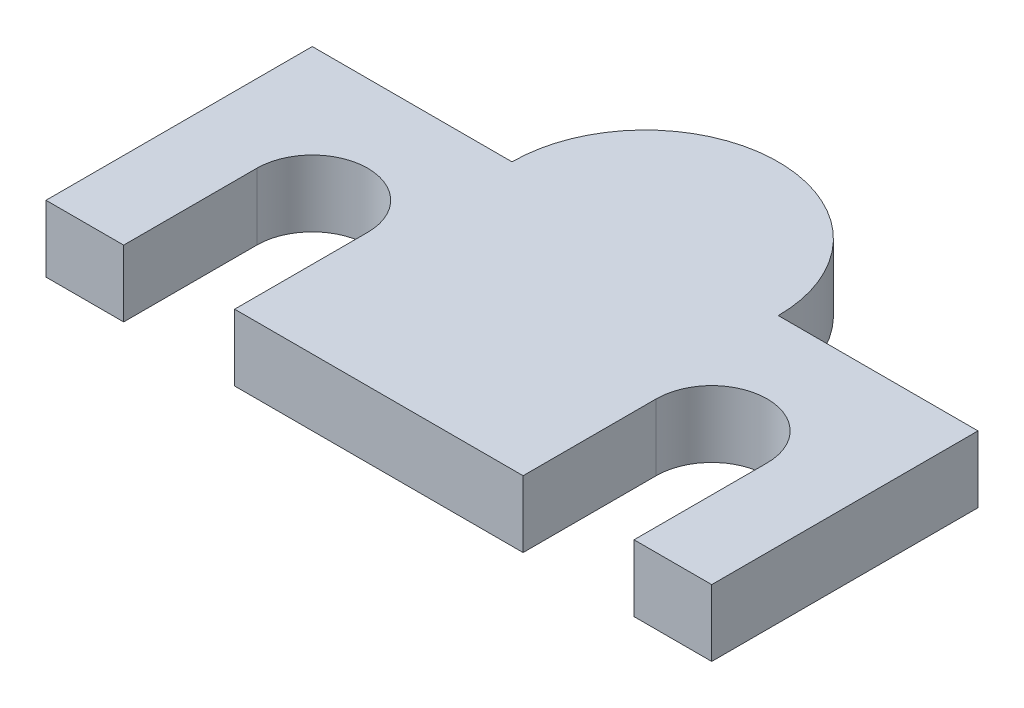
ISO-10303-21;
HEADER;
FILE_DESCRIPTION(('STEP AP214'),'2;1');
FILE_NAME('part.step','',(''),(''),'','','');
FILE_SCHEMA(('AUTOMOTIVE_DESIGN { 1 0 10303 214 1 1 1 1 }'));
ENDSEC;
DATA;
#1=APPLICATION_CONTEXT('core data for automotive mechanical design processes');
#2=APPLICATION_PROTOCOL_DEFINITION('international standard','automotive_design',2000,#1);
#3=PRODUCT_CONTEXT('',#1,'mechanical');
#4=PRODUCT('Part','Part','',(#3));
#5=PRODUCT_RELATED_PRODUCT_CATEGORY('part','',(#4));
#6=PRODUCT_DEFINITION_FORMATION('','',#4);
#7=PRODUCT_DEFINITION_CONTEXT('part definition',#1,'design');
#8=PRODUCT_DEFINITION('design','',#6,#7);
#9=PRODUCT_DEFINITION_SHAPE('','',#8);
#10=(LENGTH_UNIT() NAMED_UNIT(*) SI_UNIT(.MILLI.,.METRE.));
#11=(NAMED_UNIT(*) PLANE_ANGLE_UNIT() SI_UNIT($,.RADIAN.));
#12=(NAMED_UNIT(*) SI_UNIT($,.STERADIAN.) SOLID_ANGLE_UNIT());
#13=UNCERTAINTY_MEASURE_WITH_UNIT(LENGTH_MEASURE(1.E-05),#10,'distance_accuracy_value','');
#14=(GEOMETRIC_REPRESENTATION_CONTEXT(3) GLOBAL_UNCERTAINTY_ASSIGNED_CONTEXT((#13)) GLOBAL_UNIT_ASSIGNED_CONTEXT((#10,
#11,#12)) REPRESENTATION_CONTEXT('',''));
#15=CARTESIAN_POINT('',(0.,0.,0.));
#16=DIRECTION('',(0.,0.,1.));
#17=DIRECTION('',(1.,0.,0.));
#18=AXIS2_PLACEMENT_3D('',#15,#16,#17);
#19=CARTESIAN_POINT('',(15.,3.,-6.));
#20=DIRECTION('',(0.,0.,1.));
#21=DIRECTION('',(1.,0.,0.));
#22=AXIS2_PLACEMENT_3D('',#19,#20,#21);
#23=PLANE('',#22);
#24=DIRECTION('',(-1.,0.,0.));
#25=VECTOR('',#24,1.);
#26=CARTESIAN_POINT('',(15.,3.,-6.));
#27=LINE('',#26,#25);
#28=CARTESIAN_POINT('',(-6.,3.,-6.));
#29=VERTEX_POINT('',#28);
#30=CARTESIAN_POINT('',(-15.,3.,-6.));
#31=VERTEX_POINT('',#30);
#32=EDGE_CURVE('E48',#29,#31,#27,.T.);
#33=ORIENTED_EDGE('',*,*,#32,.F.);
#34=DIRECTION('',(0.,-1.,0.));
#35=VECTOR('',#34,1.);
#36=CARTESIAN_POINT('',(-6.,3.,-6.));
#37=LINE('',#36,#35);
#38=CARTESIAN_POINT('',(-6.,0.,-6.));
#39=VERTEX_POINT('',#38);
#40=EDGE_CURVE('E147',#29,#39,#37,.T.);
#41=ORIENTED_EDGE('',*,*,#40,.T.);
#42=DIRECTION('',(-1.,0.,0.));
#43=VECTOR('',#42,1.);
#44=CARTESIAN_POINT('',(15.,0.,-6.));
#45=LINE('',#44,#43);
#46=CARTESIAN_POINT('',(-15.,0.,-6.));
#47=VERTEX_POINT('',#46);
#48=EDGE_CURVE('E136',#39,#47,#45,.T.);
#49=ORIENTED_EDGE('',*,*,#48,.T.);
#50=DIRECTION('',(0.,-1.,0.));
#51=VECTOR('',#50,1.);
#52=CARTESIAN_POINT('',(-15.,3.,-6.));
#53=LINE('',#52,#51);
#54=EDGE_CURVE('E223',#31,#47,#53,.T.);
#55=ORIENTED_EDGE('',*,*,#54,.F.);
#56=EDGE_LOOP('',(#33,#41,#49,#55));
#57=FACE_BOUND('',#56,.T.);
#58=ADVANCED_FACE('F33',(#57),#23,.F.);
#59=CARTESIAN_POINT('',(15.,3.,6.));
#60=DIRECTION('',(0.,0.,-1.));
#61=DIRECTION('',(-1.,0.,0.));
#62=AXIS2_PLACEMENT_3D('',#59,#60,#61);
#63=PLANE('',#62);
#64=DIRECTION('',(0.,1.,0.));
#65=VECTOR('',#64,1.);
#66=CARTESIAN_POINT('',(6.5,0.,6.));
#67=LINE('',#66,#65);
#68=CARTESIAN_POINT('',(6.5,0.,6.));
#69=VERTEX_POINT('',#68);
#70=CARTESIAN_POINT('',(6.5,3.,6.));
#71=VERTEX_POINT('',#70);
#72=EDGE_CURVE('E207',#69,#71,#67,.T.);
#73=ORIENTED_EDGE('',*,*,#72,.T.);
#74=DIRECTION('',(1.,0.,0.));
#75=VECTOR('',#74,1.);
#76=CARTESIAN_POINT('',(15.,3.,6.));
#77=LINE('',#76,#75);
#78=CARTESIAN_POINT('',(-6.5,3.,6.));
#79=VERTEX_POINT('',#78);
#80=EDGE_CURVE('E219',#79,#71,#77,.T.);
#81=ORIENTED_EDGE('',*,*,#80,.F.);
#82=DIRECTION('',(0.,1.,0.));
#83=VECTOR('',#82,1.);
#84=CARTESIAN_POINT('',(-6.5,0.,6.));
#85=LINE('',#84,#83);
#86=CARTESIAN_POINT('',(-6.5,0.,6.));
#87=VERTEX_POINT('',#86);
#88=EDGE_CURVE('E180',#87,#79,#85,.T.);
#89=ORIENTED_EDGE('',*,*,#88,.F.);
#90=DIRECTION('',(1.,0.,0.));
#91=VECTOR('',#90,1.);
#92=CARTESIAN_POINT('',(15.,0.,6.));
#93=LINE('',#92,#91);
#94=EDGE_CURVE('E229',#87,#69,#93,.T.);
#95=ORIENTED_EDGE('',*,*,#94,.T.);
#96=EDGE_LOOP('',(#73,#81,#89,#95));
#97=FACE_BOUND('',#96,.T.);
#98=ADVANCED_FACE('F260',(#97),#63,.F.);
#99=CARTESIAN_POINT('',(11.5,3.,6.));
#100=VERTEX_POINT('',#99);
#101=CARTESIAN_POINT('',(15.,3.,6.));
#102=VERTEX_POINT('',#101);
#103=EDGE_CURVE('E214',#100,#102,#77,.T.);
#104=ORIENTED_EDGE('',*,*,#103,.F.);
#105=DIRECTION('',(0.,1.,0.));
#106=VECTOR('',#105,1.);
#107=CARTESIAN_POINT('',(11.5,0.,6.));
#108=LINE('',#107,#106);
#109=CARTESIAN_POINT('',(11.5,0.,6.));
#110=VERTEX_POINT('',#109);
#111=EDGE_CURVE('E205',#110,#100,#108,.T.);
#112=ORIENTED_EDGE('',*,*,#111,.F.);
#113=CARTESIAN_POINT('',(15.,0.,6.));
#114=VERTEX_POINT('',#113);
#115=EDGE_CURVE('E225',#110,#114,#93,.T.);
#116=ORIENTED_EDGE('',*,*,#115,.T.);
#117=DIRECTION('',(0.,-1.,0.));
#118=VECTOR('',#117,1.);
#119=CARTESIAN_POINT('',(15.,3.,6.));
#120=LINE('',#119,#118);
#121=EDGE_CURVE('E41',#102,#114,#120,.T.);
#122=ORIENTED_EDGE('',*,*,#121,.F.);
#123=EDGE_LOOP('',(#104,#112,#116,#122));
#124=FACE_BOUND('',#123,.T.);
#125=ADVANCED_FACE('F262',(#124),#63,.F.);
#126=CARTESIAN_POINT('',(-15.,3.,-6.));
#127=DIRECTION('',(1.,0.,0.));
#128=DIRECTION('',(0.,0.,-1.));
#129=AXIS2_PLACEMENT_3D('',#126,#127,#128);
#130=PLANE('',#129);
#131=DIRECTION('',(0.,0.,1.));
#132=VECTOR('',#131,1.);
#133=CARTESIAN_POINT('',(-15.,0.,-6.));
#134=LINE('',#133,#132);
#135=CARTESIAN_POINT('',(-15.,0.,6.));
#136=VERTEX_POINT('',#135);
#137=EDGE_CURVE('E142',#47,#136,#134,.T.);
#138=ORIENTED_EDGE('',*,*,#137,.T.);
#139=DIRECTION('',(0.,-1.,0.));
#140=VECTOR('',#139,1.);
#141=CARTESIAN_POINT('',(-15.,3.,6.));
#142=LINE('',#141,#140);
#143=CARTESIAN_POINT('',(-15.,3.,6.));
#144=VERTEX_POINT('',#143);
#145=EDGE_CURVE('E11',#144,#136,#142,.T.);
#146=ORIENTED_EDGE('',*,*,#145,.F.);
#147=DIRECTION('',(0.,0.,1.));
#148=VECTOR('',#147,1.);
#149=CARTESIAN_POINT('',(-15.,3.,-6.));
#150=LINE('',#149,#148);
#151=EDGE_CURVE('E211',#31,#144,#150,.T.);
#152=ORIENTED_EDGE('',*,*,#151,.F.);
#153=ORIENTED_EDGE('',*,*,#54,.T.);
#154=EDGE_LOOP('',(#138,#146,#152,#153));
#155=FACE_BOUND('',#154,.T.);
#156=ADVANCED_FACE('F35',(#155),#130,.F.);
#157=CARTESIAN_POINT('',(-11.5,0.,6.));
#158=VERTEX_POINT('',#157);
#159=EDGE_CURVE('E226',#136,#158,#93,.T.);
#160=ORIENTED_EDGE('',*,*,#159,.T.);
#161=DIRECTION('',(0.,1.,0.));
#162=VECTOR('',#161,1.);
#163=CARTESIAN_POINT('',(-11.5,0.,6.));
#164=LINE('',#163,#162);
#165=CARTESIAN_POINT('',(-11.5,3.,6.));
#166=VERTEX_POINT('',#165);
#167=EDGE_CURVE('E182',#158,#166,#164,.T.);
#168=ORIENTED_EDGE('',*,*,#167,.T.);
#169=EDGE_CURVE('E215',#144,#166,#77,.T.);
#170=ORIENTED_EDGE('',*,*,#169,.F.);
#171=ORIENTED_EDGE('',*,*,#145,.T.);
#172=EDGE_LOOP('',(#160,#168,#170,#171));
#173=FACE_BOUND('',#172,.T.);
#174=ADVANCED_FACE('F283',(#173),#63,.F.);
#175=CARTESIAN_POINT('',(15.,3.,-6.));
#176=DIRECTION('',(-1.,0.,0.));
#177=DIRECTION('',(0.,0.,1.));
#178=AXIS2_PLACEMENT_3D('',#175,#176,#177);
#179=PLANE('',#178);
#180=DIRECTION('',(0.,0.,-1.));
#181=VECTOR('',#180,1.);
#182=CARTESIAN_POINT('',(15.,0.,-6.));
#183=LINE('',#182,#181);
#184=CARTESIAN_POINT('',(15.,0.,-6.));
#185=VERTEX_POINT('',#184);
#186=EDGE_CURVE('E145',#114,#185,#183,.T.);
#187=ORIENTED_EDGE('',*,*,#186,.T.);
#188=DIRECTION('',(0.,-1.,0.));
#189=VECTOR('',#188,1.);
#190=CARTESIAN_POINT('',(15.,3.,-6.));
#191=LINE('',#190,#189);
#192=CARTESIAN_POINT('',(15.,3.,-6.));
#193=VERTEX_POINT('',#192);
#194=EDGE_CURVE('E232',#193,#185,#191,.T.);
#195=ORIENTED_EDGE('',*,*,#194,.F.);
#196=DIRECTION('',(0.,0.,-1.));
#197=VECTOR('',#196,1.);
#198=CARTESIAN_POINT('',(15.,3.,-6.));
#199=LINE('',#198,#197);
#200=EDGE_CURVE('E218',#102,#193,#199,.T.);
#201=ORIENTED_EDGE('',*,*,#200,.F.);
#202=ORIENTED_EDGE('',*,*,#121,.T.);
#203=EDGE_LOOP('',(#187,#195,#201,#202));
#204=FACE_BOUND('',#203,.T.);
#205=ADVANCED_FACE('F239',(#204),#179,.F.);
#206=CARTESIAN_POINT('',(6.,0.,-6.));
#207=VERTEX_POINT('',#206);
#208=EDGE_CURVE('E144',#185,#207,#45,.T.);
#209=ORIENTED_EDGE('',*,*,#208,.T.);
#210=DIRECTION('',(0.,-1.,0.));
#211=VECTOR('',#210,1.);
#212=CARTESIAN_POINT('',(6.,3.,-6.));
#213=LINE('',#212,#211);
#214=CARTESIAN_POINT('',(6.,3.,-6.));
#215=VERTEX_POINT('',#214);
#216=EDGE_CURVE('E56',#215,#207,#213,.T.);
#217=ORIENTED_EDGE('',*,*,#216,.F.);
#218=EDGE_CURVE('E221',#193,#215,#27,.T.);
#219=ORIENTED_EDGE('',*,*,#218,.F.);
#220=ORIENTED_EDGE('',*,*,#194,.T.);
#221=EDGE_LOOP('',(#209,#217,#219,#220));
#222=FACE_BOUND('',#221,.T.);
#223=ADVANCED_FACE('F244',(#222),#23,.F.);
#224=CARTESIAN_POINT('',(0.,3.,0.));
#225=DIRECTION('',(0.,-1.,0.));
#226=DIRECTION('',(0.,0.,-1.));
#227=AXIS2_PLACEMENT_3D('',#224,#225,#226);
#228=PLANE('',#227);
#229=ORIENTED_EDGE('',*,*,#218,.T.);
#230=CARTESIAN_POINT('',(0.,3.,-6.));
#231=DIRECTION('',(0.,-1.,0.));
#232=DIRECTION('',(0.,0.,-1.));
#233=AXIS2_PLACEMENT_3D('',#230,#231,#232);
#234=CIRCLE('',#233,6.);
#235=EDGE_CURVE('E154',#29,#215,#234,.T.);
#236=ORIENTED_EDGE('',*,*,#235,.F.);
#237=ORIENTED_EDGE('',*,*,#32,.T.);
#238=ORIENTED_EDGE('',*,*,#151,.T.);
#239=ORIENTED_EDGE('',*,*,#169,.T.);
#240=DIRECTION('',(0.,0.,1.));
#241=VECTOR('',#240,1.);
#242=CARTESIAN_POINT('',(-11.5,3.,0.));
#243=LINE('',#242,#241);
#244=CARTESIAN_POINT('',(-11.5,3.,0.));
#245=VERTEX_POINT('',#244);
#246=EDGE_CURVE('E173',#245,#166,#243,.T.);
#247=ORIENTED_EDGE('',*,*,#246,.F.);
#248=CARTESIAN_POINT('',(-9.,3.,0.));
#249=DIRECTION('',(0.,1.,0.));
#250=DIRECTION('',(0.,0.,1.));
#251=AXIS2_PLACEMENT_3D('',#248,#249,#250);
#252=CIRCLE('',#251,2.5);
#253=CARTESIAN_POINT('',(-6.5,3.,0.));
#254=VERTEX_POINT('',#253);
#255=EDGE_CURVE('E170',#254,#245,#252,.T.);
#256=ORIENTED_EDGE('',*,*,#255,.F.);
#257=DIRECTION('',(0.,0.,-1.));
#258=VECTOR('',#257,1.);
#259=CARTESIAN_POINT('',(-6.5,3.,0.));
#260=LINE('',#259,#258);
#261=EDGE_CURVE('E163',#79,#254,#260,.T.);
#262=ORIENTED_EDGE('',*,*,#261,.F.);
#263=ORIENTED_EDGE('',*,*,#80,.T.);
#264=DIRECTION('',(0.,0.,1.));
#265=VECTOR('',#264,1.);
#266=CARTESIAN_POINT('',(6.5,3.,0.));
#267=LINE('',#266,#265);
#268=CARTESIAN_POINT('',(6.5,3.,0.));
#269=VERTEX_POINT('',#268);
#270=EDGE_CURVE('E199',#269,#71,#267,.T.);
#271=ORIENTED_EDGE('',*,*,#270,.F.);
#272=CARTESIAN_POINT('',(9.,3.,0.));
#273=DIRECTION('',(0.,1.,0.));
#274=DIRECTION('',(0.,0.,1.));
#275=AXIS2_PLACEMENT_3D('',#272,#273,#274);
#276=CIRCLE('',#275,2.5);
#277=CARTESIAN_POINT('',(11.5,3.,0.));
#278=VERTEX_POINT('',#277);
#279=EDGE_CURVE('E151',#278,#269,#276,.T.);
#280=ORIENTED_EDGE('',*,*,#279,.F.);
#281=DIRECTION('',(0.,0.,-1.));
#282=VECTOR('',#281,1.);
#283=CARTESIAN_POINT('',(11.5,3.,0.));
#284=LINE('',#283,#282);
#285=EDGE_CURVE('E190',#100,#278,#284,.T.);
#286=ORIENTED_EDGE('',*,*,#285,.F.);
#287=ORIENTED_EDGE('',*,*,#103,.T.);
#288=ORIENTED_EDGE('',*,*,#200,.T.);
#289=EDGE_LOOP('',(#229,#236,#237,#238,#239,#247,#256,#262,#263,#271,#280,#286,#287,#288));
#290=FACE_BOUND('',#289,.T.);
#291=ADVANCED_FACE('F246',(#290),#228,.F.);
#292=CARTESIAN_POINT('',(0.,0.,0.));
#293=DIRECTION('',(0.,-1.,0.));
#294=DIRECTION('',(0.,0.,-1.));
#295=AXIS2_PLACEMENT_3D('',#292,#293,#294);
#296=PLANE('',#295);
#297=ORIENTED_EDGE('',*,*,#48,.F.);
#298=CARTESIAN_POINT('',(0.,0.,-6.));
#299=DIRECTION('',(0.,-1.,0.));
#300=DIRECTION('',(0.,0.,-1.));
#301=AXIS2_PLACEMENT_3D('',#298,#299,#300);
#302=CIRCLE('',#301,6.);
#303=EDGE_CURVE('E140',#39,#207,#302,.T.);
#304=ORIENTED_EDGE('',*,*,#303,.T.);
#305=ORIENTED_EDGE('',*,*,#208,.F.);
#306=ORIENTED_EDGE('',*,*,#186,.F.);
#307=ORIENTED_EDGE('',*,*,#115,.F.);
#308=DIRECTION('',(0.,0.,-1.));
#309=VECTOR('',#308,1.);
#310=CARTESIAN_POINT('',(11.5,0.,0.));
#311=LINE('',#310,#309);
#312=CARTESIAN_POINT('',(11.5,0.,0.));
#313=VERTEX_POINT('',#312);
#314=EDGE_CURVE('E193',#110,#313,#311,.T.);
#315=ORIENTED_EDGE('',*,*,#314,.T.);
#316=CARTESIAN_POINT('',(9.,0.,0.));
#317=DIRECTION('',(0.,1.,0.));
#318=DIRECTION('',(0.,0.,1.));
#319=AXIS2_PLACEMENT_3D('',#316,#317,#318);
#320=CIRCLE('',#319,2.5);
#321=CARTESIAN_POINT('',(6.5,0.,0.));
#322=VERTEX_POINT('',#321);
#323=EDGE_CURVE('E186',#313,#322,#320,.T.);
#324=ORIENTED_EDGE('',*,*,#323,.T.);
#325=DIRECTION('',(0.,0.,1.));
#326=VECTOR('',#325,1.);
#327=CARTESIAN_POINT('',(6.5,0.,0.));
#328=LINE('',#327,#326);
#329=EDGE_CURVE('E189',#322,#69,#328,.T.);
#330=ORIENTED_EDGE('',*,*,#329,.T.);
#331=ORIENTED_EDGE('',*,*,#94,.F.);
#332=DIRECTION('',(0.,0.,-1.));
#333=VECTOR('',#332,1.);
#334=CARTESIAN_POINT('',(-6.5,0.,0.));
#335=LINE('',#334,#333);
#336=CARTESIAN_POINT('',(-6.5,0.,0.));
#337=VERTEX_POINT('',#336);
#338=EDGE_CURVE('E166',#87,#337,#335,.T.);
#339=ORIENTED_EDGE('',*,*,#338,.T.);
#340=CARTESIAN_POINT('',(-9.,0.,0.));
#341=DIRECTION('',(0.,1.,0.));
#342=DIRECTION('',(0.,0.,1.));
#343=AXIS2_PLACEMENT_3D('',#340,#341,#342);
#344=CIRCLE('',#343,2.5);
#345=CARTESIAN_POINT('',(-11.5,0.,0.));
#346=VERTEX_POINT('',#345);
#347=EDGE_CURVE('E159',#337,#346,#344,.T.);
#348=ORIENTED_EDGE('',*,*,#347,.T.);
#349=DIRECTION('',(0.,0.,1.));
#350=VECTOR('',#349,1.);
#351=CARTESIAN_POINT('',(-11.5,0.,0.));
#352=LINE('',#351,#350);
#353=EDGE_CURVE('E162',#346,#158,#352,.T.);
#354=ORIENTED_EDGE('',*,*,#353,.T.);
#355=ORIENTED_EDGE('',*,*,#159,.F.);
#356=ORIENTED_EDGE('',*,*,#137,.F.);
#357=EDGE_LOOP('',(#297,#304,#305,#306,#307,#315,#324,#330,#331,#339,#348,#354,#355,#356));
#358=FACE_BOUND('',#357,.T.);
#359=ADVANCED_FACE('F137',(#358),#296,.T.);
#360=CARTESIAN_POINT('',(9.,0.,0.));
#361=DIRECTION('',(0.,1.,0.));
#362=DIRECTION('',(0.,0.,1.));
#363=AXIS2_PLACEMENT_3D('',#360,#361,#362);
#364=CYLINDRICAL_SURFACE('',#363,2.5);
#365=ORIENTED_EDGE('',*,*,#279,.T.);
#366=DIRECTION('',(0.,1.,0.));
#367=VECTOR('',#366,1.);
#368=CARTESIAN_POINT('',(6.5,0.,0.));
#369=LINE('',#368,#367);
#370=EDGE_CURVE('E196',#322,#269,#369,.T.);
#371=ORIENTED_EDGE('',*,*,#370,.F.);
#372=ORIENTED_EDGE('',*,*,#323,.F.);
#373=DIRECTION('',(0.,1.,0.));
#374=VECTOR('',#373,1.);
#375=CARTESIAN_POINT('',(11.5,0.,0.));
#376=LINE('',#375,#374);
#377=EDGE_CURVE('E174',#313,#278,#376,.T.);
#378=ORIENTED_EDGE('',*,*,#377,.T.);
#379=EDGE_LOOP('',(#365,#371,#372,#378));
#380=FACE_BOUND('',#379,.T.);
#381=ADVANCED_FACE('F267',(#380),#364,.F.);
#382=CARTESIAN_POINT('',(11.5,0.,0.));
#383=DIRECTION('',(1.,0.,0.));
#384=DIRECTION('',(0.,0.,-1.));
#385=AXIS2_PLACEMENT_3D('',#382,#383,#384);
#386=PLANE('',#385);
#387=ORIENTED_EDGE('',*,*,#285,.T.);
#388=ORIENTED_EDGE('',*,*,#377,.F.);
#389=ORIENTED_EDGE('',*,*,#314,.F.);
#390=ORIENTED_EDGE('',*,*,#111,.T.);
#391=EDGE_LOOP('',(#387,#388,#389,#390));
#392=FACE_BOUND('',#391,.T.);
#393=ADVANCED_FACE('F264',(#392),#386,.F.);
#394=CARTESIAN_POINT('',(6.5,0.,0.));
#395=DIRECTION('',(-1.,0.,0.));
#396=DIRECTION('',(0.,0.,1.));
#397=AXIS2_PLACEMENT_3D('',#394,#395,#396);
#398=PLANE('',#397);
#399=ORIENTED_EDGE('',*,*,#270,.T.);
#400=ORIENTED_EDGE('',*,*,#72,.F.);
#401=ORIENTED_EDGE('',*,*,#329,.F.);
#402=ORIENTED_EDGE('',*,*,#370,.T.);
#403=EDGE_LOOP('',(#399,#400,#401,#402));
#404=FACE_BOUND('',#403,.T.);
#405=ADVANCED_FACE('F258',(#404),#398,.F.);
#406=CARTESIAN_POINT('',(-9.,0.,0.));
#407=DIRECTION('',(0.,1.,0.));
#408=DIRECTION('',(0.,0.,1.));
#409=AXIS2_PLACEMENT_3D('',#406,#407,#408);
#410=CYLINDRICAL_SURFACE('',#409,2.5);
#411=ORIENTED_EDGE('',*,*,#255,.T.);
#412=DIRECTION('',(0.,1.,0.));
#413=VECTOR('',#412,1.);
#414=CARTESIAN_POINT('',(-11.5,0.,0.));
#415=LINE('',#414,#413);
#416=EDGE_CURVE('E169',#346,#245,#415,.T.);
#417=ORIENTED_EDGE('',*,*,#416,.F.);
#418=ORIENTED_EDGE('',*,*,#347,.F.);
#419=DIRECTION('',(0.,1.,0.));
#420=VECTOR('',#419,1.);
#421=CARTESIAN_POINT('',(-6.5,0.,0.));
#422=LINE('',#421,#420);
#423=EDGE_CURVE('E178',#337,#254,#422,.T.);
#424=ORIENTED_EDGE('',*,*,#423,.T.);
#425=EDGE_LOOP('',(#411,#417,#418,#424));
#426=FACE_BOUND('',#425,.T.);
#427=ADVANCED_FACE('F359',(#426),#410,.F.);
#428=CARTESIAN_POINT('',(-6.5,0.,0.));
#429=DIRECTION('',(1.,0.,0.));
#430=DIRECTION('',(0.,0.,-1.));
#431=AXIS2_PLACEMENT_3D('',#428,#429,#430);
#432=PLANE('',#431);
#433=ORIENTED_EDGE('',*,*,#261,.T.);
#434=ORIENTED_EDGE('',*,*,#423,.F.);
#435=ORIENTED_EDGE('',*,*,#338,.F.);
#436=ORIENTED_EDGE('',*,*,#88,.T.);
#437=EDGE_LOOP('',(#433,#434,#435,#436));
#438=FACE_BOUND('',#437,.T.);
#439=ADVANCED_FACE('F366',(#438),#432,.F.);
#440=CARTESIAN_POINT('',(-11.5,0.,0.));
#441=DIRECTION('',(-1.,0.,0.));
#442=DIRECTION('',(0.,0.,1.));
#443=AXIS2_PLACEMENT_3D('',#440,#441,#442);
#444=PLANE('',#443);
#445=ORIENTED_EDGE('',*,*,#246,.T.);
#446=ORIENTED_EDGE('',*,*,#167,.F.);
#447=ORIENTED_EDGE('',*,*,#353,.F.);
#448=ORIENTED_EDGE('',*,*,#416,.T.);
#449=EDGE_LOOP('',(#445,#446,#447,#448));
#450=FACE_BOUND('',#449,.T.);
#451=ADVANCED_FACE('F375',(#450),#444,.F.);
#452=CARTESIAN_POINT('',(0.,3.,-6.));
#453=DIRECTION('',(0.,-1.,0.));
#454=DIRECTION('',(0.,0.,-1.));
#455=AXIS2_PLACEMENT_3D('',#452,#453,#454);
#456=CYLINDRICAL_SURFACE('',#455,6.);
#457=ORIENTED_EDGE('',*,*,#303,.F.);
#458=ORIENTED_EDGE('',*,*,#40,.F.);
#459=ORIENTED_EDGE('',*,*,#235,.T.);
#460=ORIENTED_EDGE('',*,*,#216,.T.);
#461=EDGE_LOOP('',(#457,#458,#459,#460));
#462=FACE_BOUND('',#461,.T.);
#463=ADVANCED_FACE('F153',(#462),#456,.T.);
#464=CLOSED_SHELL('',(#58,#98,#125,#156,#174,#205,#223,#291,#359,#381,#393,#405,#427,#439,#451,#463));
#465=MANIFOLD_SOLID_BREP('B2',#464);
#466=ADVANCED_BREP_SHAPE_REPRESENTATION('',(#18,#465),#14);
#467=SHAPE_DEFINITION_REPRESENTATION(#9,#466);
ENDSEC;
END-ISO-10303-21;
